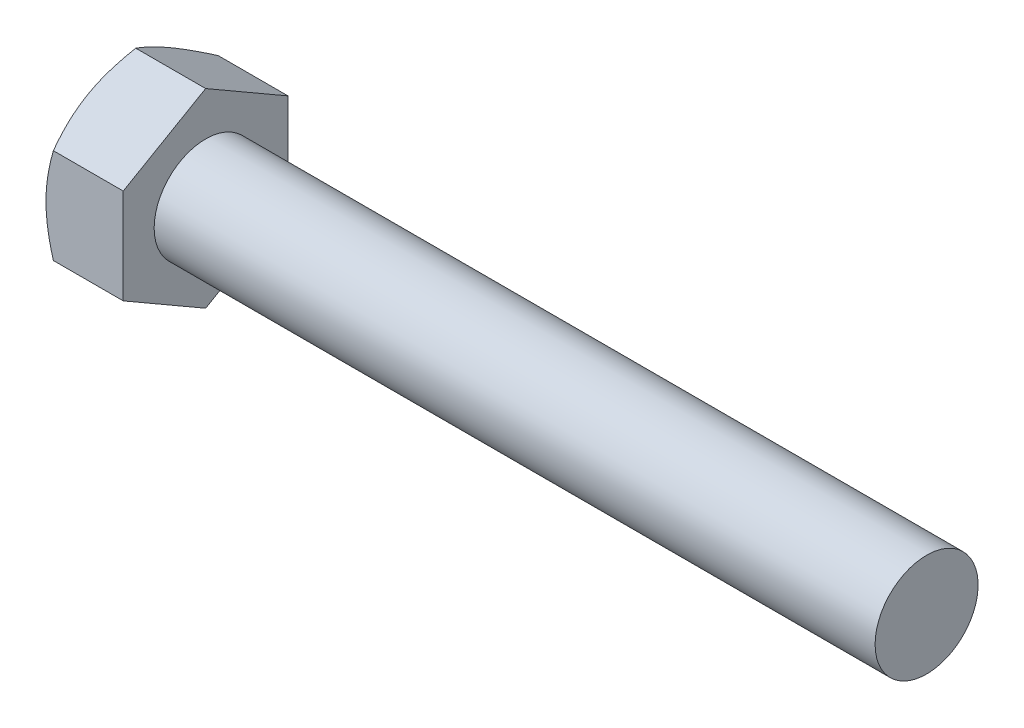
ISO-10303-21;
HEADER;
FILE_DESCRIPTION(('STEP AP214'),'2;1');
FILE_NAME('part.step','',(''),(''),'','','');
FILE_SCHEMA(('AUTOMOTIVE_DESIGN { 1 0 10303 214 1 1 1 1 }'));
ENDSEC;
DATA;
#1=APPLICATION_CONTEXT('core data for automotive mechanical design processes');
#2=APPLICATION_PROTOCOL_DEFINITION('international standard','automotive_design',2000,#1);
#3=PRODUCT_CONTEXT('',#1,'mechanical');
#4=PRODUCT('Part','Part','',(#3));
#5=PRODUCT_RELATED_PRODUCT_CATEGORY('part','',(#4));
#6=PRODUCT_DEFINITION_FORMATION('','',#4);
#7=PRODUCT_DEFINITION_CONTEXT('part definition',#1,'design');
#8=PRODUCT_DEFINITION('design','',#6,#7);
#9=PRODUCT_DEFINITION_SHAPE('','',#8);
#10=(LENGTH_UNIT() NAMED_UNIT(*) SI_UNIT(.MILLI.,.METRE.));
#11=(NAMED_UNIT(*) PLANE_ANGLE_UNIT() SI_UNIT($,.RADIAN.));
#12=(NAMED_UNIT(*) SI_UNIT($,.STERADIAN.) SOLID_ANGLE_UNIT());
#13=UNCERTAINTY_MEASURE_WITH_UNIT(LENGTH_MEASURE(1.E-05),#10,'distance_accuracy_value','');
#14=(GEOMETRIC_REPRESENTATION_CONTEXT(3) GLOBAL_UNCERTAINTY_ASSIGNED_CONTEXT((#13)) GLOBAL_UNIT_ASSIGNED_CONTEXT((#10,
#11,#12)) REPRESENTATION_CONTEXT('',''));
#15=CARTESIAN_POINT('',(0.,0.,0.));
#16=DIRECTION('',(0.,0.,1.));
#17=DIRECTION('',(1.,0.,0.));
#18=AXIS2_PLACEMENT_3D('',#15,#16,#17);
#19=CARTESIAN_POINT('',(0.,0.,0.));
#20=DIRECTION('',(-1.,0.,0.));
#21=DIRECTION('',(0.,0.,1.00000000000001));
#22=AXIS2_PLACEMENT_3D('',#19,#20,#21);
#23=PLANE('',#22);
#24=CARTESIAN_POINT('',(0.,0.,0.));
#25=DIRECTION('',(-1.,0.,0.));
#26=DIRECTION('',(0.,0.,1.00000000000001));
#27=AXIS2_PLACEMENT_3D('',#24,#25,#26);
#28=CIRCLE('',#27,8.);
#29=CARTESIAN_POINT('',(0.,0.,8.00000000000001));
#30=VERTEX_POINT('',#29);
#31=CARTESIAN_POINT('',(0.,6.92820324541336,4.00000002621942));
#32=VERTEX_POINT('',#31);
#33=EDGE_CURVE('E55',#30,#32,#28,.T.);
#34=ORIENTED_EDGE('',*,*,#33,.T.);
#35=CARTESIAN_POINT('',(0.,6.92820324541336,-4.00000002621942));
#36=VERTEX_POINT('',#35);
#37=EDGE_CURVE('E211',#32,#36,#28,.T.);
#38=ORIENTED_EDGE('',*,*,#37,.T.);
#39=CARTESIAN_POINT('',(0.,0.,-7.99999999999998));
#40=VERTEX_POINT('',#39);
#41=EDGE_CURVE('E216',#36,#40,#28,.T.);
#42=ORIENTED_EDGE('',*,*,#41,.T.);
#43=CARTESIAN_POINT('',(0.,-6.92820324541317,-4.00000002621931));
#44=VERTEX_POINT('',#43);
#45=EDGE_CURVE('E220',#40,#44,#28,.T.);
#46=ORIENTED_EDGE('',*,*,#45,.T.);
#47=CARTESIAN_POINT('',(0.,-6.92820324541317,4.00000002621931));
#48=VERTEX_POINT('',#47);
#49=EDGE_CURVE('E217',#44,#48,#28,.T.);
#50=ORIENTED_EDGE('',*,*,#49,.T.);
#51=EDGE_CURVE('E209',#48,#30,#28,.T.);
#52=ORIENTED_EDGE('',*,*,#51,.T.);
#53=EDGE_LOOP('',(#34,#38,#42,#46,#50,#52));
#54=FACE_BOUND('',#53,.T.);
#55=CARTESIAN_POINT('',(0.,0.,0.));
#56=DIRECTION('',(1.,0.,0.));
#57=DIRECTION('',(0.,0.,-1.00000000000001));
#58=AXIS2_PLACEMENT_3D('',#55,#56,#57);
#59=CIRCLE('',#58,7.);
#60=CARTESIAN_POINT('',(0.,0.,-7.00000000000004));
#61=VERTEX_POINT('',#60);
#62=EDGE_CURVE('E248',#61,#61,#59,.T.);
#63=ORIENTED_EDGE('',*,*,#62,.T.);
#64=EDGE_LOOP('',(#63));
#65=FACE_BOUND('',#64,.T.);
#66=ADVANCED_FACE('F47',(#54,#65),#23,.T.);
#67=CARTESIAN_POINT('',(7.5,5.00000000000002,0.));
#68=DIRECTION('',(-1.,0.,0.));
#69=DIRECTION('',(0.,0.,1.00000000000001));
#70=AXIS2_PLACEMENT_3D('',#67,#68,#69);
#71=PLANE('',#70);
#72=CARTESIAN_POINT('',(7.5,0.,0.));
#73=DIRECTION('',(-1.,0.,0.));
#74=DIRECTION('',(0.,0.,1.00000000000001));
#75=AXIS2_PLACEMENT_3D('',#72,#73,#74);
#76=CIRCLE('',#75,5.);
#77=CARTESIAN_POINT('',(7.5,0.,5.00000000000003));
#78=VERTEX_POINT('',#77);
#79=EDGE_CURVE('E207',#78,#78,#76,.T.);
#80=ORIENTED_EDGE('',*,*,#79,.T.);
#81=EDGE_LOOP('',(#80));
#82=FACE_BOUND('',#81,.T.);
#83=DIRECTION('',(0.,1.,0.));
#84=VECTOR('',#83,1.);
#85=CARTESIAN_POINT('',(7.5,-4.61880217370055,8.00000000000001));
#86=LINE('',#85,#84);
#87=CARTESIAN_POINT('',(7.5,-4.61880217370055,8.00000000000001));
#88=VERTEX_POINT('',#87);
#89=CARTESIAN_POINT('',(7.5,4.61880217370081,8.00000000000001));
#90=VERTEX_POINT('',#89);
#91=EDGE_CURVE('E70',#88,#90,#86,.T.);
#92=ORIENTED_EDGE('',*,*,#91,.F.);
#93=DIRECTION('',(0.,0.500000001638711,0.866025402838333));
#94=VECTOR('',#93,1.);
#95=CARTESIAN_POINT('',(7.5,-9.23760434740123,0.));
#96=LINE('',#95,#94);
#97=CARTESIAN_POINT('',(7.5,-9.23760434740123,0.));
#98=VERTEX_POINT('',#97);
#99=EDGE_CURVE('E144',#98,#88,#96,.T.);
#100=ORIENTED_EDGE('',*,*,#99,.F.);
#101=DIRECTION('',(0.,-0.500000001638711,0.866025402838334));
#102=VECTOR('',#101,1.);
#103=CARTESIAN_POINT('',(7.5,-4.61880217370056,-7.99999999999998));
#104=LINE('',#103,#102);
#105=CARTESIAN_POINT('',(7.5,-4.61880217370056,-7.99999999999998));
#106=VERTEX_POINT('',#105);
#107=EDGE_CURVE('E142',#106,#98,#104,.T.);
#108=ORIENTED_EDGE('',*,*,#107,.F.);
#109=DIRECTION('',(0.,-1.,0.));
#110=VECTOR('',#109,1.);
#111=CARTESIAN_POINT('',(7.5,4.61880217370079,-8.00000000000001));
#112=LINE('',#111,#110);
#113=CARTESIAN_POINT('',(7.5,4.61880217370079,-8.00000000000001));
#114=VERTEX_POINT('',#113);
#115=EDGE_CURVE('E124',#114,#106,#112,.T.);
#116=ORIENTED_EDGE('',*,*,#115,.F.);
#117=DIRECTION('',(0.,-0.500000001638711,-0.866025402838334));
#118=VECTOR('',#117,1.);
#119=CARTESIAN_POINT('',(7.5,9.23760434740149,0.));
#120=LINE('',#119,#118);
#121=CARTESIAN_POINT('',(7.5,9.23760434740149,0.));
#122=VERTEX_POINT('',#121);
#123=EDGE_CURVE('E133',#122,#114,#120,.T.);
#124=ORIENTED_EDGE('',*,*,#123,.F.);
#125=DIRECTION('',(0.,0.500000001638711,-0.866025402838334));
#126=VECTOR('',#125,1.);
#127=CARTESIAN_POINT('',(7.5,4.61880217370081,8.00000000000001));
#128=LINE('',#127,#126);
#129=EDGE_CURVE('E137',#90,#122,#128,.T.);
#130=ORIENTED_EDGE('',*,*,#129,.F.);
#131=EDGE_LOOP('',(#92,#100,#108,#116,#124,#130));
#132=FACE_BOUND('',#131,.T.);
#133=ADVANCED_FACE('F139',(#82,#132),#71,.F.);
#134=CARTESIAN_POINT('',(-25.4,0.,0.));
#135=DIRECTION('',(-1.,0.,0.));
#136=DIRECTION('',(0.,0.,1.00000000000001));
#137=AXIS2_PLACEMENT_3D('',#134,#135,#136);
#138=CYLINDRICAL_SURFACE('',#137,5.);
#139=CARTESIAN_POINT('',(77.5,0.,0.));
#140=DIRECTION('',(-1.,0.,0.));
#141=DIRECTION('',(0.,0.,1.00000000000001));
#142=AXIS2_PLACEMENT_3D('',#139,#140,#141);
#143=CIRCLE('',#142,5.);
#144=CARTESIAN_POINT('',(77.5,0.,5.00000000000003));
#145=VERTEX_POINT('',#144);
#146=EDGE_CURVE('E13',#145,#145,#143,.T.);
#147=ORIENTED_EDGE('',*,*,#146,.T.);
#148=EDGE_LOOP('',(#147));
#149=FACE_BOUND('',#148,.T.);
#150=ORIENTED_EDGE('',*,*,#79,.F.);
#151=EDGE_LOOP('',(#150));
#152=FACE_BOUND('',#151,.T.);
#153=ADVANCED_FACE('F49',(#149,#152),#138,.T.);
#154=CARTESIAN_POINT('',(77.5,5.00000000000002,0.));
#155=DIRECTION('',(1.,0.,0.));
#156=DIRECTION('',(0.,0.,-1.00000000000001));
#157=AXIS2_PLACEMENT_3D('',#154,#155,#156);
#158=PLANE('',#157);
#159=ORIENTED_EDGE('',*,*,#146,.F.);
#160=EDGE_LOOP('',(#159));
#161=FACE_BOUND('',#160,.T.);
#162=ADVANCED_FACE('F190',(#161),#158,.T.);
#163=CARTESIAN_POINT('',(7.5,-4.61880217370055,8.00000000000001));
#164=DIRECTION('',(0.,0.,1.00000000000001));
#165=DIRECTION('',(0.,-1.,0.));
#166=AXIS2_PLACEMENT_3D('',#163,#164,#165);
#167=PLANE('',#166);
#168=DIRECTION('',(-1.,0.,0.));
#169=VECTOR('',#168,1.);
#170=CARTESIAN_POINT('',(7.5,-4.61880217370055,8.00000000000001));
#171=LINE('',#170,#169);
#172=CARTESIAN_POINT('',(0.714531185642811,-4.61880217370055,8.00000000000001));
#173=VERTEX_POINT('',#172);
#174=EDGE_CURVE('E151',#88,#173,#171,.T.);
#175=ORIENTED_EDGE('',*,*,#174,.F.);
#176=ORIENTED_EDGE('',*,*,#91,.T.);
#177=DIRECTION('',(-1.,0.,0.));
#178=VECTOR('',#177,1.);
#179=CARTESIAN_POINT('',(7.5,4.61880217370081,8.00000000000001));
#180=LINE('',#179,#178);
#181=CARTESIAN_POINT('',(0.714531185642887,4.61880217370081,8.00000000000001));
#182=VERTEX_POINT('',#181);
#183=EDGE_CURVE('E150',#90,#182,#180,.T.);
#184=ORIENTED_EDGE('',*,*,#183,.T.);
#185=CARTESIAN_POINT('',(3.82822414101115,-12.2497656982226,8.00000000000001));
#186=CARTESIAN_POINT('',(3.65848286879736,-11.8985202843054,8.00000000000001));
#187=CARTESIAN_POINT('',(3.49042895769107,-11.5464444212051,8.00000000000001));
#188=CARTESIAN_POINT('',(3.15866007606799,-10.8401827517385,8.00000000000001));
#189=CARTESIAN_POINT('',(2.9949458567854,-10.4859965928939,8.00000000000001));
#190=CARTESIAN_POINT('',(2.67195812645106,-9.77315201266958,8.00000000000001));
#191=CARTESIAN_POINT('',(2.51271538890515,-9.41447959727729,8.00000000000001));
#192=CARTESIAN_POINT('',(2.20106973608566,-8.69418687082215,8.00000000000001));
#193=CARTESIAN_POINT('',(2.04866646428541,-8.33256671458259,8.00000000000001));
#194=CARTESIAN_POINT('',(1.7507091261062,-7.60131370455934,8.));
#195=CARTESIAN_POINT('',(1.60526212024159,-7.23163698414159,8.));
#196=CARTESIAN_POINT('',(1.32575932370833,-6.48792416090309,8.00000000000001));
#197=CARTESIAN_POINT('',(1.19170480039109,-6.1138875783209,8.00000000000003));
#198=CARTESIAN_POINT('',(0.938589488850584,-5.36162356561343,7.99999999999998));
#199=CARTESIAN_POINT('',(0.819496824182997,-4.98340697934687,7.99999999999992));
#200=CARTESIAN_POINT('',(0.60017099790859,-4.22161055060649,8.00000000000009));
#201=CARTESIAN_POINT('',(0.4999318722784,-3.83803244555424,8.00000000000032));
#202=CARTESIAN_POINT('',(0.323186748232357,-3.06518689861546,8.00000000000031));
#203=CARTESIAN_POINT('',(0.246687067909622,-2.67591797096959,8.00000000000006));
#204=CARTESIAN_POINT('',(0.15357252725391,-2.08858914234219,7.99999999999998));
#205=CARTESIAN_POINT('',(0.126138156302363,-1.89221786409492,8.));
#206=CARTESIAN_POINT('',(0.0790208692877711,-1.49855462524946,8.00000000000001));
#207=CARTESIAN_POINT('',(0.0593371858268486,-1.30126275775724,8.00000000000001));
#208=CARTESIAN_POINT('',(0.0282509892994688,-0.907276578206978,8.00000000000001));
#209=CARTESIAN_POINT('',(0.0167970522476403,-0.710586340026194,8.00000000000001));
#210=CARTESIAN_POINT('',(0.00223090595897365,-0.316897324952186,8.00000000000001));
#211=CARTESIAN_POINT('',(-0.000881411608058605,-0.119898552099056,8.00000000000001));
#212=CARTESIAN_POINT('',(0.00130984053934697,0.273997538414011,8.00000000000001));
#213=CARTESIAN_POINT('',(0.00661104833169325,0.470894869030584,8.00000000000001));
#214=CARTESIAN_POINT('',(0.0254975236721249,0.864294473957523,8.00000000000001));
#215=CARTESIAN_POINT('',(0.0390832049236066,1.06079672804718,8.00000000000001));
#216=CARTESIAN_POINT('',(0.0817669665798419,1.53705699197597,8.00000000000001));
#217=CARTESIAN_POINT('',(0.115015825491787,1.81644908989181,8.00000000000001));
#218=CARTESIAN_POINT('',(0.196415724202101,2.37309234461892,8.00000000000001));
#219=CARTESIAN_POINT('',(0.244570831513711,2.65034289586914,8.00000000000001));
#220=CARTESIAN_POINT('',(0.354075319593898,3.20247432368565,8.00000000000001));
#221=CARTESIAN_POINT('',(0.415437175577188,3.47735270235344,8.00000000000001));
#222=CARTESIAN_POINT('',(0.549482936842535,4.02428135859502,8.00000000000001));
#223=CARTESIAN_POINT('',(0.622165775535718,4.29633190001607,8.00000000000001));
#224=CARTESIAN_POINT('',(0.779014575856638,4.8443054564892,8.00000000000001));
#225=CARTESIAN_POINT('',(0.863418343438949,5.12015993256326,8.00000000000001));
#226=CARTESIAN_POINT('',(1.04056550506418,5.66895309638316,8.00000000000001));
#227=CARTESIAN_POINT('',(1.13330314694986,5.9418936519788,8.00000000000001));
#228=CARTESIAN_POINT('',(1.32520246628365,6.48376376437685,8.00000000000001));
#229=CARTESIAN_POINT('',(1.42432504691621,6.75270725047685,8.));
#230=CARTESIAN_POINT('',(1.62838816906518,7.28850759026014,8.00000000000002));
#231=CARTESIAN_POINT('',(1.73333106198455,7.55536355016899,8.00000000000004));
#232=CARTESIAN_POINT('',(1.84060835471515,7.82125004980534,8.00000000000009));
#233=B_SPLINE_CURVE_WITH_KNOTS('',3,(#185,#186,#187,#188,#189,#190,#191,#192,#193,#194,#195,
#196,#197,#198,#199,#200,#201,#202,#203,#204,#205,#206,#207,#208,#209,#210,#211,#212,#213,#214,
#215,#216,#217,#218,#219,#220,#221,#222,#223,#224,#225,#226,#227,#228,#229,#230,#231,#232),
.UNSPECIFIED.,.F.,.F.,(4,2,2,2,2,2,2,2,2,2,2,2,2,2,2,2,2,2,2,2,2,2,2,4),(0.,1.1703442661722,
2.3408898221639,3.51813389970134,4.69531653857874,5.8869516573956,7.0787191660534,
8.26790291341447,9.45670984600016,10.6458329007114,11.2405391306506,11.8351864637341,
12.4260850123375,13.0169758870757,13.6077009108411,14.1984554361754,15.0420758899104,
15.8859267481502,16.7305782416716,17.5751502057393,18.4404245595524,19.3051062097702,
20.1649208601746,21.0250854420212),.UNSPECIFIED.);
#234=EDGE_CURVE('E192',#30,#182,#233,.T.);
#235=ORIENTED_EDGE('',*,*,#234,.F.);
#236=EDGE_CURVE('E199',#173,#30,#233,.T.);
#237=ORIENTED_EDGE('',*,*,#236,.F.);
#238=EDGE_LOOP('',(#175,#176,#184,#235,#237));
#239=FACE_BOUND('',#238,.T.);
#240=ADVANCED_FACE('F186',(#239),#167,.T.);
#241=CARTESIAN_POINT('',(7.5,-9.23760434740123,0.));
#242=DIRECTION('',(0.,-0.866025402838329,0.500000001638712));
#243=DIRECTION('',(0.,-0.500000001638711,-0.866025402838333));
#244=AXIS2_PLACEMENT_3D('',#241,#242,#243);
#245=PLANE('',#244);
#246=DIRECTION('',(-1.,0.,0.));
#247=VECTOR('',#246,1.);
#248=CARTESIAN_POINT('',(7.5,-9.23760434740123,0.));
#249=LINE('',#248,#247);
#250=CARTESIAN_POINT('',(0.71453120312235,-9.23760434740123,0.));
#251=VERTEX_POINT('',#250);
#252=EDGE_CURVE('E155',#98,#251,#249,.T.);
#253=ORIENTED_EDGE('',*,*,#252,.F.);
#254=ORIENTED_EDGE('',*,*,#99,.T.);
#255=ORIENTED_EDGE('',*,*,#174,.T.);
#256=CARTESIAN_POINT('',(0.714597871039294,-9.2377198174556,-0.000199999999977996));
#257=CARTESIAN_POINT('',(0.655990736923305,-9.1361934740003,0.175648784402805));
#258=CARTESIAN_POINT('',(0.600043423495618,-9.03428860437913,0.35215319535403));
#259=CARTESIAN_POINT('',(0.494201026626133,-8.82965126370277,0.706595464982379));
#260=CARTESIAN_POINT('',(0.444308555613358,-8.7269184556666,0.884533907327672));
#261=CARTESIAN_POINT('',(0.304692817146081,-8.41707515629909,1.42119824187182));
#262=CARTESIAN_POINT('',(0.22528119011256,-8.20874157525887,1.78204258757939));
#263=CARTESIAN_POINT('',(0.132161664305384,-7.89697439751329,2.32203917720736));
#264=CARTESIAN_POINT('',(0.105634598683677,-7.79447219608365,2.49957819719533));
#265=CARTESIAN_POINT('',(0.061153191832178,-7.58900424766935,2.85545912162067));
#266=CARTESIAN_POINT('',(0.0431980931629679,-7.4860385424529,3.03380095371339));
#267=CARTESIAN_POINT('',(0.0163156645301102,-7.27992984087247,3.39079169517273));
#268=CARTESIAN_POINT('',(0.00737808929916151,-7.17678717937825,3.56944002452792));
#269=CARTESIAN_POINT('',(-0.00127768080583391,-6.97040657400776,3.92690171716437));
#270=CARTESIAN_POINT('',(-0.000996160506702649,-6.86716863317371,4.10571507517634));
#271=CARTESIAN_POINT('',(0.00814503983248526,-6.67416141624368,4.44001337966577));
#272=CARTESIAN_POINT('',(0.0158896186877148,-6.58437852030024,4.59552191641092));
#273=CARTESIAN_POINT('',(0.0382011486356442,-6.40502300933047,4.90617477267051));
#274=CARTESIAN_POINT('',(0.0527685596255847,-6.31545040888835,5.06131906692437));
#275=CARTESIAN_POINT('',(0.106360703064375,-6.04707937863193,5.52615132457682));
#276=CARTESIAN_POINT('',(0.155268653484353,-5.86875598870037,5.83501649476649));
#277=CARTESIAN_POINT('',(0.277539413477505,-5.5102175789927,6.45602323413139));
#278=CARTESIAN_POINT('',(0.351420529762532,-5.3300483182299,6.768085546371));
#279=CARTESIAN_POINT('',(0.519100148881194,-4.97239660419654,7.38755648378386));
#280=CARTESIAN_POINT('',(0.612859267577913,-4.79490957082322,7.69497304192776));
#281=CARTESIAN_POINT('',(0.714597853559096,-4.61868670364621,8.00020000000001));
#282=B_SPLINE_CURVE_WITH_KNOTS('',3,(#256,#257,#258,#259,#260,#261,#262,#263,#264,#265,#266,
#267,#268,#269,#270,#271,#272,#273,#274,#275,#276,#277,#278,#279,#280,#281),.UNSPECIFIED.,.F.,
.F.,(4,2,2,2,2,2,2,2,2,2,2,2,4),(0.,0.633973546459013,1.26821966262013,2.53934713534089,
3.15934345345194,3.77928497706707,4.39852135771861,5.01773860688774,5.55680241439713,
6.09590256306805,7.17487079008232,8.27776851436756,9.37850116222514),.UNSPECIFIED.);
#283=EDGE_CURVE('E201',#48,#173,#282,.T.);
#284=ORIENTED_EDGE('',*,*,#283,.F.);
#285=EDGE_CURVE('E200',#251,#48,#282,.T.);
#286=ORIENTED_EDGE('',*,*,#285,.F.);
#287=EDGE_LOOP('',(#253,#254,#255,#284,#286));
#288=FACE_BOUND('',#287,.T.);
#289=ADVANCED_FACE('F189',(#288),#245,.T.);
#290=CARTESIAN_POINT('',(7.5,-4.61880217370056,-7.99999999999998));
#291=DIRECTION('',(0.,-0.86602540283833,-0.500000001638713));
#292=DIRECTION('',(0.,0.500000001638711,-0.866025402838334));
#293=AXIS2_PLACEMENT_3D('',#290,#291,#292);
#294=PLANE('',#293);
#295=DIRECTION('',(-1.,0.,0.));
#296=VECTOR('',#295,1.);
#297=CARTESIAN_POINT('',(7.5,-4.61880217370056,-7.99999999999998));
#298=LINE('',#297,#296);
#299=CARTESIAN_POINT('',(0.714531185642811,-4.61880217370056,-7.99999999999998));
#300=VERTEX_POINT('',#299);
#301=EDGE_CURVE('E130',#106,#300,#298,.T.);
#302=ORIENTED_EDGE('',*,*,#301,.F.);
#303=ORIENTED_EDGE('',*,*,#107,.T.);
#304=ORIENTED_EDGE('',*,*,#252,.T.);
#305=CARTESIAN_POINT('',(0.714597853559096,-4.61868670364622,-8.00019999999999));
#306=CARTESIAN_POINT('',(0.65599072016065,-4.72021304685639,-7.82435121602173));
#307=CARTESIAN_POINT('',(0.600043407468504,-4.82211791623126,-7.64784680549709));
#308=CARTESIAN_POINT('',(0.494201012103494,-5.0267552564099,-7.2934045367308));
#309=CARTESIAN_POINT('',(0.444308541859664,-5.12948806419465,-7.11546609482099));
#310=CARTESIAN_POINT('',(0.304692805754261,-5.43933136278075,-6.57880176163029));
#311=CARTESIAN_POINT('',(0.225281180357148,-5.64766494327925,-6.217957416861));
#312=CARTESIAN_POINT('',(0.132161657001094,-5.95943212018716,-5.67796082868392));
#313=CARTESIAN_POINT('',(0.105634592184729,-6.0619343213433,-5.50042180916967));
#314=CARTESIAN_POINT('',(0.0611531869346916,-6.26740226919473,-5.14454088571924));
#315=CARTESIAN_POINT('',(0.0431980890616099,-6.37036797412182,-4.96619905412771));
#316=CARTESIAN_POINT('',(0.0163156619914887,-6.57647667510865,-4.60920831369651));
#317=CARTESIAN_POINT('',(0.00737808752736387,-6.67961933629866,-4.43055998486821));
#318=CARTESIAN_POINT('',(-0.00127768109245527,-6.88599994104395,-4.07309829331467));
#319=CARTESIAN_POINT('',(-0.000996160074954426,-6.989237881557,-3.89428493585871));
#320=CARTESIAN_POINT('',(0.0081450415739356,-7.18224509847463,-3.55998663139076));
#321=CARTESIAN_POINT('',(0.015889621075367,-7.27202799472788,-3.40447809410898));
#322=CARTESIAN_POINT('',(0.0382011523455438,-7.45138350630456,-3.09382523679817));
#323=CARTESIAN_POINT('',(0.052768564011541,-7.54095610704378,-2.93868094202974));
#324=CARTESIAN_POINT('',(0.1063607095047,-7.80932713817442,-2.47384868286308));
#325=CARTESIAN_POINT('',(0.155268661328194,-7.98765052866432,-2.16498351170635));
#326=CARTESIAN_POINT('',(0.277539424141242,-8.34618893947714,-1.54397677042726));
#327=CARTESIAN_POINT('',(0.351420541844094,-8.52635820078573,-1.23191445724232));
#328=CARTESIAN_POINT('',(0.519100163726656,-8.88400991587954,-0.612443517992715));
#329=CARTESIAN_POINT('',(0.61285928376889,-9.06149694976765,-0.305026958957202));
#330=CARTESIAN_POINT('',(0.714597871039294,-9.23771981745573,0.000200000000227796));
#331=B_SPLINE_CURVE_WITH_KNOTS('',3,(#305,#306,#307,#308,#309,#310,#311,#312,#313,#314,#315,
#316,#317,#318,#319,#320,#321,#322,#323,#324,#325,#326,#327,#328,#329,#330),.UNSPECIFIED.,.F.,
.F.,(4,2,2,2,2,2,2,2,2,2,2,2,4),(0.,0.633973544448735,1.26821965859847,2.53934712719802,
3.15934344337152,3.77928496504981,4.39852134377934,5.01773859102757,5.55680240047662,
6.09590255108804,7.1748707819939,8.27776851034666,9.37850116222591),.UNSPECIFIED.);
#332=EDGE_CURVE('E230',#44,#251,#331,.T.);
#333=ORIENTED_EDGE('',*,*,#332,.F.);
#334=EDGE_CURVE('E235',#300,#44,#331,.T.);
#335=ORIENTED_EDGE('',*,*,#334,.F.);
#336=EDGE_LOOP('',(#302,#303,#304,#333,#335));
#337=FACE_BOUND('',#336,.T.);
#338=ADVANCED_FACE('F331',(#337),#294,.T.);
#339=CARTESIAN_POINT('',(7.5,4.61880217370079,-8.00000000000001));
#340=DIRECTION('',(0.,0.,-1.00000000000001));
#341=DIRECTION('',(-1.,0.,0.));
#342=AXIS2_PLACEMENT_3D('',#339,#340,#341);
#343=PLANE('',#342);
#344=DIRECTION('',(-1.,0.,0.));
#345=VECTOR('',#344,1.);
#346=CARTESIAN_POINT('',(7.5,4.61880217370079,-8.00000000000001));
#347=LINE('',#346,#345);
#348=CARTESIAN_POINT('',(0.714531185642887,4.61880217370079,-8.00000000000001));
#349=VERTEX_POINT('',#348);
#350=EDGE_CURVE('E119',#114,#349,#347,.T.);
#351=ORIENTED_EDGE('',*,*,#350,.F.);
#352=ORIENTED_EDGE('',*,*,#115,.T.);
#353=ORIENTED_EDGE('',*,*,#301,.T.);
#354=CARTESIAN_POINT('',(3.82822414101115,-12.2497656982226,-8.00000000000001));
#355=CARTESIAN_POINT('',(3.65848286879736,-11.8985202843054,-8.00000000000001));
#356=CARTESIAN_POINT('',(3.49042895769106,-11.546444421205,-8.00000000000001));
#357=CARTESIAN_POINT('',(3.15866007606798,-10.8401827517385,-8.00000000000001));
#358=CARTESIAN_POINT('',(2.99494585678539,-10.4859965928938,-8.00000000000001));
#359=CARTESIAN_POINT('',(2.67195812645105,-9.77315201266956,-8.00000000000001));
#360=CARTESIAN_POINT('',(2.51271538890514,-9.41447959727727,-8.00000000000001));
#361=CARTESIAN_POINT('',(2.20106973608565,-8.69418687082212,-8.00000000000001));
#362=CARTESIAN_POINT('',(2.04866646428539,-8.33256671458255,-8.00000000000001));
#363=CARTESIAN_POINT('',(1.75070912610618,-7.6013137045593,-8.00000000000001));
#364=CARTESIAN_POINT('',(1.60526212024157,-7.23163698414153,-8.00000000000001));
#365=CARTESIAN_POINT('',(1.3257593237083,-6.48792416090302,-8.00000000000001));
#366=CARTESIAN_POINT('',(1.19170480039107,-6.11388757832083,-8.));
#367=CARTESIAN_POINT('',(0.938589488850555,-5.36162356561334,-8.00000000000002));
#368=CARTESIAN_POINT('',(0.819496824182962,-4.98340697934678,-8.00000000000004));
#369=CARTESIAN_POINT('',(0.60017099790857,-4.22161055060638,-7.99999999999998));
#370=CARTESIAN_POINT('',(0.4999318722784,-3.83803244555413,-7.99999999999989));
#371=CARTESIAN_POINT('',(0.32318674823236,-3.06518689861534,-7.9999999999999));
#372=CARTESIAN_POINT('',(0.246687067909605,-2.67591797096948,-7.99999999999999));
#373=CARTESIAN_POINT('',(0.153572527253893,-2.0885891423421,-8.00000000000002));
#374=CARTESIAN_POINT('',(0.126138156302349,-1.89221786409482,-8.00000000000001));
#375=CARTESIAN_POINT('',(0.0790208692877615,-1.49855462524937,-8.));
#376=CARTESIAN_POINT('',(0.059337185826839,-1.30126275775716,-8.00000000000001));
#377=CARTESIAN_POINT('',(0.0282509892994617,-0.907276578206903,-8.00000000000001));
#378=CARTESIAN_POINT('',(0.0167970522476358,-0.710586340026123,-8.00000000000001));
#379=CARTESIAN_POINT('',(0.0022309059589714,-0.316897324952123,-8.00000000000001));
#380=CARTESIAN_POINT('',(-0.00088141160806109,-0.119898552099,-8.00000000000001));
#381=CARTESIAN_POINT('',(0.00130984053934643,0.273997538414058,-8.00000000000001));
#382=CARTESIAN_POINT('',(0.00661104833169495,0.470894869030628,-8.00000000000001));
#383=CARTESIAN_POINT('',(0.025497523672124,0.864294473957558,-8.00000000000001));
#384=CARTESIAN_POINT('',(0.0390832049236008,1.06079672804721,-8.00000000000001));
#385=CARTESIAN_POINT('',(0.0817669665798336,1.537056991976,-8.00000000000001));
#386=CARTESIAN_POINT('',(0.115015825491785,1.81644908989183,-8.00000000000001));
#387=CARTESIAN_POINT('',(0.196415724202103,2.37309234461893,-8.00000000000001));
#388=CARTESIAN_POINT('',(0.24457083151371,2.65034289586914,-8.00000000000001));
#389=CARTESIAN_POINT('',(0.354075319593895,3.20247432368565,-8.00000000000001));
#390=CARTESIAN_POINT('',(0.415437175577185,3.47735270235344,-8.00000000000001));
#391=CARTESIAN_POINT('',(0.54948293684253,4.02428135859501,-8.00000000000001));
#392=CARTESIAN_POINT('',(0.622165775535711,4.29633190001606,-8.00000000000001));
#393=CARTESIAN_POINT('',(0.779014575856629,4.84430545648918,-8.00000000000001));
#394=CARTESIAN_POINT('',(0.863418343438939,5.12015993256324,-8.00000000000001));
#395=CARTESIAN_POINT('',(1.04056550506417,5.66895309638313,-8.00000000000001));
#396=CARTESIAN_POINT('',(1.13330314694984,5.94189365197876,-8.00000000000001));
#397=CARTESIAN_POINT('',(1.32520246628363,6.48376376437681,-8.00000000000001));
#398=CARTESIAN_POINT('',(1.42432504691619,6.75270725047681,-8.00000000000001));
#399=CARTESIAN_POINT('',(1.62838816906516,7.28850759026009,-8.));
#400=CARTESIAN_POINT('',(1.73333106198454,7.55536355016894,-7.99999999999999));
#401=CARTESIAN_POINT('',(1.84060835471514,7.82125004980529,-7.99999999999995));
#402=B_SPLINE_CURVE_WITH_KNOTS('',3,(#354,#355,#356,#357,#358,#359,#360,#361,#362,#363,#364,
#365,#366,#367,#368,#369,#370,#371,#372,#373,#374,#375,#376,#377,#378,#379,#380,#381,#382,#383,
#384,#385,#386,#387,#388,#389,#390,#391,#392,#393,#394,#395,#396,#397,#398,#399,#400,#401),
.UNSPECIFIED.,.F.,.F.,(4,2,2,2,2,2,2,2,2,2,2,2,2,2,2,2,2,2,2,2,2,2,2,4),(0.,1.17034426617222,
2.34088982216393,3.51813389970137,4.69531653857878,5.88695165739566,7.07871916605348,
8.26790291341457,9.45670984600028,10.6458329007115,11.2405391306507,11.8351864637341,
12.4260850123376,13.0169758870758,13.6077009108412,14.1984554361754,15.0420758899104,
15.8859267481502,16.7305782416715,17.5751502057393,18.4404245595523,19.3051062097701,
20.1649208601746,21.0250854420212),.UNSPECIFIED.);
#403=EDGE_CURVE('E231',#40,#300,#402,.F.);
#404=ORIENTED_EDGE('',*,*,#403,.F.);
#405=EDGE_CURVE('E127',#349,#40,#402,.F.);
#406=ORIENTED_EDGE('',*,*,#405,.F.);
#407=EDGE_LOOP('',(#351,#352,#353,#404,#406));
#408=FACE_BOUND('',#407,.T.);
#409=ADVANCED_FACE('F121',(#408),#343,.T.);
#410=CARTESIAN_POINT('',(7.5,9.23760434740149,0.));
#411=DIRECTION('',(0.,0.86602540283833,-0.500000001638712));
#412=DIRECTION('',(0.,0.500000001638711,0.866025402838334));
#413=AXIS2_PLACEMENT_3D('',#410,#411,#412);
#414=PLANE('',#413);
#415=DIRECTION('',(-1.,0.,0.));
#416=VECTOR('',#415,1.);
#417=CARTESIAN_POINT('',(7.5,9.23760434740149,0.));
#418=LINE('',#417,#416);
#419=CARTESIAN_POINT('',(0.714531203122502,9.23760434740149,0.));
#420=VERTEX_POINT('',#419);
#421=EDGE_CURVE('E62',#122,#420,#418,.T.);
#422=ORIENTED_EDGE('',*,*,#421,.F.);
#423=ORIENTED_EDGE('',*,*,#123,.T.);
#424=ORIENTED_EDGE('',*,*,#350,.T.);
#425=CARTESIAN_POINT('',(0.714597871039439,9.23771981745582,0.000200000000033507));
#426=CARTESIAN_POINT('',(0.655990736923457,9.13619347400055,-0.175648784402777));
#427=CARTESIAN_POINT('',(0.600043423495771,9.03428860437939,-0.352153195354016));
#428=CARTESIAN_POINT('',(0.494201026626286,8.82965126370304,-0.706595464982382));
#429=CARTESIAN_POINT('',(0.444308555613508,8.72691845566687,-0.884533907327677));
#430=CARTESIAN_POINT('',(0.304692817146226,8.41707515629934,-1.42119824187183));
#431=CARTESIAN_POINT('',(0.225281190112702,8.20874157525912,-1.78204258757941));
#432=CARTESIAN_POINT('',(0.132161664305523,7.89697439751353,-2.3220391772074));
#433=CARTESIAN_POINT('',(0.105634598683815,7.79447219608389,-2.49957819719537));
#434=CARTESIAN_POINT('',(0.0611531918323127,7.58900424766959,-2.85545912162072));
#435=CARTESIAN_POINT('',(0.0431980931631013,7.48603854245313,-3.03380095371345));
#436=CARTESIAN_POINT('',(0.0163156645302427,7.27992984087269,-3.3907916951728));
#437=CARTESIAN_POINT('',(0.00737808929929465,7.17678717937847,-3.569440024528));
#438=CARTESIAN_POINT('',(-0.00127768080570434,6.97040657400797,-3.92690171716446));
#439=CARTESIAN_POINT('',(-0.000996160506577304,6.86716863317391,-4.10571507517642));
#440=CARTESIAN_POINT('',(0.00814503983260949,6.67416141624388,-4.44001337966585));
#441=CARTESIAN_POINT('',(0.0158896186878408,6.58437852030045,-4.595521916411));
#442=CARTESIAN_POINT('',(0.0382011486357698,6.4050230093307,-4.90617477267058));
#443=CARTESIAN_POINT('',(0.0527685596257082,6.31545040888857,-5.06131906692444));
#444=CARTESIAN_POINT('',(0.106360703064492,6.04707937863217,-5.52615132457686));
#445=CARTESIAN_POINT('',(0.155268653484465,5.86875598870061,-5.83501649476652));
#446=CARTESIAN_POINT('',(0.277539413477603,5.51021757899296,-6.4560232341314));
#447=CARTESIAN_POINT('',(0.351420529762621,5.33004831823017,-6.768085546371));
#448=CARTESIAN_POINT('',(0.519100148881271,4.97239660419681,-7.38755648378383));
#449=CARTESIAN_POINT('',(0.612859267577986,4.79490957082349,-7.6949730419277));
#450=CARTESIAN_POINT('',(0.714597853559172,4.61868670364646,-8.00019999999993));
#451=B_SPLINE_CURVE_WITH_KNOTS('',3,(#425,#426,#427,#428,#429,#430,#431,#432,#433,#434,#435,
#436,#437,#438,#439,#440,#441,#442,#443,#444,#445,#446,#447,#448,#449,#450),.UNSPECIFIED.,.F.,
.F.,(4,2,2,2,2,2,2,2,2,2,2,2,4),(0.,0.633973546459029,1.26821966262016,2.53934713534096,
3.15934345345203,3.77928497706717,4.39852135771873,5.01773860688787,5.55680241439724,
6.09590256306814,7.17487079008237,8.27776851436756,9.3785011622251),.UNSPECIFIED.);
#452=EDGE_CURVE('E169',#36,#349,#451,.T.);
#453=ORIENTED_EDGE('',*,*,#452,.F.);
#454=EDGE_CURVE('E365',#420,#36,#451,.T.);
#455=ORIENTED_EDGE('',*,*,#454,.F.);
#456=EDGE_LOOP('',(#422,#423,#424,#453,#455));
#457=FACE_BOUND('',#456,.T.);
#458=ADVANCED_FACE('F134',(#457),#414,.T.);
#459=CARTESIAN_POINT('',(7.5,4.61880217370081,8.00000000000001));
#460=DIRECTION('',(0.,0.86602540283833,0.500000001638713));
#461=DIRECTION('',(0.,-0.500000001638711,0.866025402838334));
#462=AXIS2_PLACEMENT_3D('',#459,#460,#461);
#463=PLANE('',#462);
#464=ORIENTED_EDGE('',*,*,#183,.F.);
#465=ORIENTED_EDGE('',*,*,#129,.T.);
#466=ORIENTED_EDGE('',*,*,#421,.T.);
#467=CARTESIAN_POINT('',(0.714597853559179,4.61868670364646,8.00020000000001));
#468=CARTESIAN_POINT('',(0.655990720160739,4.72021304685663,7.82435121602177));
#469=CARTESIAN_POINT('',(0.600043407468597,4.8221179162315,7.64784680549713));
#470=CARTESIAN_POINT('',(0.494201012103594,5.02675525641014,7.29340453673084));
#471=CARTESIAN_POINT('',(0.444308541859767,5.12948806419489,7.11546609482103));
#472=CARTESIAN_POINT('',(0.304692805754372,5.43933136278098,6.57880176163035));
#473=CARTESIAN_POINT('',(0.225281180357265,5.64766494327948,6.21795741686107));
#474=CARTESIAN_POINT('',(0.132161657001217,5.95943212018738,5.67796082868399));
#475=CARTESIAN_POINT('',(0.105634592184853,6.06193432134352,5.50042180916974));
#476=CARTESIAN_POINT('',(0.0611531869348189,6.26740226919495,5.14454088571933));
#477=CARTESIAN_POINT('',(0.0431980890617388,6.37036797412204,4.9661990541278));
#478=CARTESIAN_POINT('',(0.016315661991619,6.57647667510886,4.60920831369659));
#479=CARTESIAN_POINT('',(0.00737808752749388,6.67961933629886,4.4305599848683));
#480=CARTESIAN_POINT('',(-0.00127768109232088,6.88599994104418,4.07309829331478));
#481=CARTESIAN_POINT('',(-0.000996160074815371,6.98923788155727,3.89428493585885));
#482=CARTESIAN_POINT('',(0.00814504157407406,7.18224509847488,3.5599866313909));
#483=CARTESIAN_POINT('',(0.0158896210755013,7.2720279947281,3.4044780941091));
#484=CARTESIAN_POINT('',(0.0382011523456728,7.45138350630474,3.09382523679829));
#485=CARTESIAN_POINT('',(0.0527685640116687,7.54095610704396,2.93868094202986));
#486=CARTESIAN_POINT('',(0.106360709504825,7.80932713817461,2.47384868286324));
#487=CARTESIAN_POINT('',(0.155268661328317,7.98765052866449,2.16498351170651));
#488=CARTESIAN_POINT('',(0.277539424141351,8.3461889394773,1.54397677042744));
#489=CARTESIAN_POINT('',(0.351420541844192,8.52635820078589,1.23191445724251));
#490=CARTESIAN_POINT('',(0.519100163726753,8.88400991587968,0.612443517992927));
#491=CARTESIAN_POINT('',(0.612859283768998,9.06149694976777,0.305026958957422));
#492=CARTESIAN_POINT('',(0.714597871039439,9.23771981745582,-0.000200000000005751));
#493=B_SPLINE_CURVE_WITH_KNOTS('',3,(#467,#468,#469,#470,#471,#472,#473,#474,#475,#476,#477,
#478,#479,#480,#481,#482,#483,#484,#485,#486,#487,#488,#489,#490,#491,#492),.UNSPECIFIED.,.F.,
.F.,(4,2,2,2,2,2,2,2,2,2,2,2,4),(0.,0.633973544448726,1.26821965859845,2.53934712719797,
3.15934344337146,3.77928496504974,4.39852134377926,5.01773859102748,5.55680240047651,
6.09590255108791,7.17487078199373,8.27776851034646,9.37850116222567),.UNSPECIFIED.);
#494=EDGE_CURVE('E154',#32,#420,#493,.T.);
#495=ORIENTED_EDGE('',*,*,#494,.F.);
#496=EDGE_CURVE('E168',#182,#32,#493,.T.);
#497=ORIENTED_EDGE('',*,*,#496,.F.);
#498=EDGE_LOOP('',(#464,#465,#466,#495,#497));
#499=FACE_BOUND('',#498,.T.);
#500=ADVANCED_FACE('F179',(#499),#463,.T.);
#501=CARTESIAN_POINT('',(0.,0.,0.));
#502=DIRECTION('',(1.,0.,0.));
#503=DIRECTION('',(0.,0.,-1.00000000000001));
#504=AXIS2_PLACEMENT_3D('',#501,#502,#503);
#505=CONICAL_SURFACE('',#504,8.,1.0471975511966);
#506=ORIENTED_EDGE('',*,*,#51,.F.);
#507=ORIENTED_EDGE('',*,*,#283,.T.);
#508=ORIENTED_EDGE('',*,*,#236,.T.);
#509=EDGE_LOOP('',(#506,#507,#508));
#510=FACE_BOUND('',#509,.T.);
#511=ADVANCED_FACE('F183',(#510),#505,.T.);
#512=ORIENTED_EDGE('',*,*,#49,.F.);
#513=ORIENTED_EDGE('',*,*,#332,.T.);
#514=ORIENTED_EDGE('',*,*,#285,.T.);
#515=EDGE_LOOP('',(#512,#513,#514));
#516=FACE_BOUND('',#515,.T.);
#517=ADVANCED_FACE('F240',(#516),#505,.T.);
#518=ORIENTED_EDGE('',*,*,#403,.T.);
#519=ORIENTED_EDGE('',*,*,#334,.T.);
#520=ORIENTED_EDGE('',*,*,#45,.F.);
#521=EDGE_LOOP('',(#518,#519,#520));
#522=FACE_BOUND('',#521,.T.);
#523=ADVANCED_FACE('F175',(#522),#505,.T.);
#524=ORIENTED_EDGE('',*,*,#452,.T.);
#525=ORIENTED_EDGE('',*,*,#405,.T.);
#526=ORIENTED_EDGE('',*,*,#41,.F.);
#527=EDGE_LOOP('',(#524,#525,#526));
#528=FACE_BOUND('',#527,.T.);
#529=ADVANCED_FACE('F229',(#528),#505,.T.);
#530=ORIENTED_EDGE('',*,*,#33,.F.);
#531=ORIENTED_EDGE('',*,*,#234,.T.);
#532=ORIENTED_EDGE('',*,*,#496,.T.);
#533=EDGE_LOOP('',(#530,#531,#532));
#534=FACE_BOUND('',#533,.T.);
#535=ADVANCED_FACE('F266',(#534),#505,.T.);
#536=ORIENTED_EDGE('',*,*,#494,.T.);
#537=ORIENTED_EDGE('',*,*,#454,.T.);
#538=ORIENTED_EDGE('',*,*,#37,.F.);
#539=EDGE_LOOP('',(#536,#537,#538));
#540=FACE_BOUND('',#539,.T.);
#541=ADVANCED_FACE('F257',(#540),#505,.T.);
#542=CARTESIAN_POINT('',(0.937500000000001,0.,0.));
#543=DIRECTION('',(-1.,0.,0.));
#544=DIRECTION('',(0.,0.,1.00000000000001));
#545=AXIS2_PLACEMENT_3D('',#542,#543,#544);
#546=CYLINDRICAL_SURFACE('',#545,7.);
#547=CARTESIAN_POINT('',(0.937500000000001,0.,0.));
#548=DIRECTION('',(1.,0.,0.));
#549=DIRECTION('',(0.,0.,-1.00000000000001));
#550=AXIS2_PLACEMENT_3D('',#547,#548,#549);
#551=CIRCLE('',#550,7.);
#552=CARTESIAN_POINT('',(0.937500000000001,0.,-7.00000000000004));
#553=VERTEX_POINT('',#552);
#554=EDGE_CURVE('E245',#553,#553,#551,.T.);
#555=ORIENTED_EDGE('',*,*,#554,.T.);
#556=EDGE_LOOP('',(#555));
#557=FACE_BOUND('',#556,.T.);
#558=ORIENTED_EDGE('',*,*,#62,.F.);
#559=EDGE_LOOP('',(#558));
#560=FACE_BOUND('',#559,.T.);
#561=ADVANCED_FACE('F254',(#557,#560),#546,.F.);
#562=CARTESIAN_POINT('',(0.937500000000001,0.,0.));
#563=DIRECTION('',(1.,0.,0.));
#564=DIRECTION('',(0.,0.,-1.00000000000001));
#565=AXIS2_PLACEMENT_3D('',#562,#563,#564);
#566=PLANE('',#565);
#567=ORIENTED_EDGE('',*,*,#554,.F.);
#568=EDGE_LOOP('',(#567));
#569=FACE_BOUND('',#568,.T.);
#570=ADVANCED_FACE('F256',(#569),#566,.F.);
#571=CLOSED_SHELL('',(#66,#133,#153,#162,#240,#289,#338,#409,#458,#500,#511,#517,#523,#529,#535,
#541,#561,#570));
#572=MANIFOLD_SOLID_BREP('B2',#571);
#573=ADVANCED_BREP_SHAPE_REPRESENTATION('',(#18,#572),#14);
#574=SHAPE_DEFINITION_REPRESENTATION(#9,#573);
ENDSEC;
END-ISO-10303-21;
